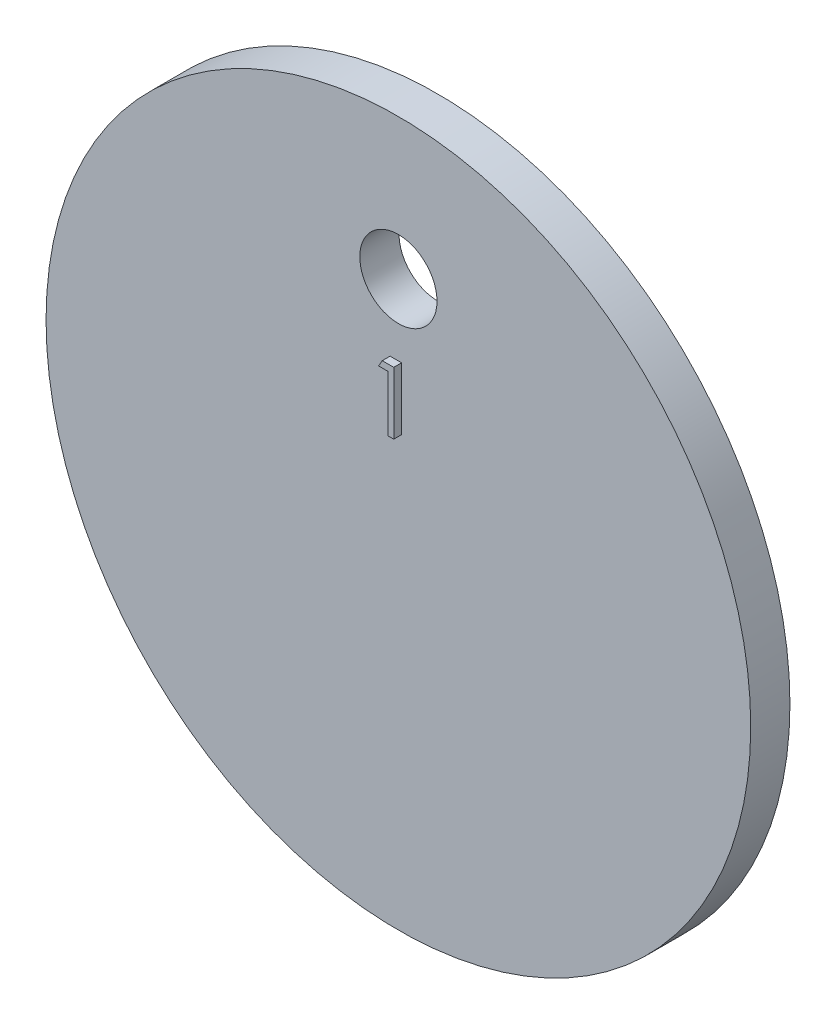
ISO-10303-21;
HEADER;
FILE_DESCRIPTION(('STEP AP214'),'2;1');
FILE_NAME('part.step','',(''),(''),'','','');
FILE_SCHEMA(('AUTOMOTIVE_DESIGN { 1 0 10303 214 1 1 1 1 }'));
ENDSEC;
DATA;
#1=APPLICATION_CONTEXT('core data for automotive mechanical design processes');
#2=APPLICATION_PROTOCOL_DEFINITION('international standard','automotive_design',2000,#1);
#3=PRODUCT_CONTEXT('',#1,'mechanical');
#4=PRODUCT('Part','Part','',(#3));
#5=PRODUCT_RELATED_PRODUCT_CATEGORY('part','',(#4));
#6=PRODUCT_DEFINITION_FORMATION('','',#4);
#7=PRODUCT_DEFINITION_CONTEXT('part definition',#1,'design');
#8=PRODUCT_DEFINITION('design','',#6,#7);
#9=PRODUCT_DEFINITION_SHAPE('','',#8);
#10=(LENGTH_UNIT() NAMED_UNIT(*) SI_UNIT(.MILLI.,.METRE.));
#11=(NAMED_UNIT(*) PLANE_ANGLE_UNIT() SI_UNIT($,.RADIAN.));
#12=(NAMED_UNIT(*) SI_UNIT($,.STERADIAN.) SOLID_ANGLE_UNIT());
#13=UNCERTAINTY_MEASURE_WITH_UNIT(LENGTH_MEASURE(1.E-05),#10,'distance_accuracy_value','');
#14=(GEOMETRIC_REPRESENTATION_CONTEXT(3) GLOBAL_UNCERTAINTY_ASSIGNED_CONTEXT((#13)) GLOBAL_UNIT_ASSIGNED_CONTEXT((#10,
#11,#12)) REPRESENTATION_CONTEXT('',''));
#15=CARTESIAN_POINT('',(0.,0.,0.));
#16=DIRECTION('',(0.,0.,1.));
#17=DIRECTION('',(1.,0.,0.));
#18=AXIS2_PLACEMENT_3D('',#15,#16,#17);
#19=CARTESIAN_POINT('',(0.,0.,5.));
#20=DIRECTION('',(0.,0.,1.));
#21=DIRECTION('',(1.,0.,0.));
#22=AXIS2_PLACEMENT_3D('',#19,#20,#21);
#23=PLANE('',#22);
#24=DIRECTION('',(0.496686511837683,0.867930013859709,0.));
#25=VECTOR('',#24,1.);
#26=CARTESIAN_POINT('',(-1.52644230769231,17.1233974358974,5.));
#27=LINE('',#26,#25);
#28=CARTESIAN_POINT('',(-1.52644230769231,17.1233974358974,5.));
#29=VERTEX_POINT('',#28);
#30=CARTESIAN_POINT('',(-1.06055939503205,17.9375,5.));
#31=VERTEX_POINT('',#30);
#32=EDGE_CURVE('E122',#29,#31,#27,.T.);
#33=ORIENTED_EDGE('',*,*,#32,.T.);
#34=DIRECTION('',(1.,0.,0.));
#35=VECTOR('',#34,1.);
#36=CARTESIAN_POINT('',(-1.06055939503205,17.9375,5.));
#37=LINE('',#36,#35);
#38=CARTESIAN_POINT('',(0.407051282051282,17.9375,5.));
#39=VERTEX_POINT('',#38);
#40=EDGE_CURVE('E91',#31,#39,#37,.T.);
#41=ORIENTED_EDGE('',*,*,#40,.T.);
#42=DIRECTION('',(0.,-1.,0.));
#43=VECTOR('',#42,1.);
#44=CARTESIAN_POINT('',(0.407051282051282,17.9375,5.));
#45=LINE('',#44,#43);
#46=CARTESIAN_POINT('',(0.407051282051282,10.,5.));
#47=VERTEX_POINT('',#46);
#48=EDGE_CURVE('E125',#39,#47,#45,.T.);
#49=ORIENTED_EDGE('',*,*,#48,.T.);
#50=DIRECTION('',(-1.,0.,0.));
#51=VECTOR('',#50,1.);
#52=CARTESIAN_POINT('',(0.407051282051282,10.,5.));
#53=LINE('',#52,#51);
#54=CARTESIAN_POINT('',(-0.305288461538461,10.,5.));
#55=VERTEX_POINT('',#54);
#56=EDGE_CURVE('E127',#47,#55,#53,.T.);
#57=ORIENTED_EDGE('',*,*,#56,.T.);
#58=DIRECTION('',(0.,1.,0.));
#59=VECTOR('',#58,1.);
#60=CARTESIAN_POINT('',(-0.305288461538461,10.,5.));
#61=LINE('',#60,#59);
#62=CARTESIAN_POINT('',(-0.305288461538461,17.1233974358974,5.));
#63=VERTEX_POINT('',#62);
#64=EDGE_CURVE('E53',#55,#63,#61,.T.);
#65=ORIENTED_EDGE('',*,*,#64,.T.);
#66=DIRECTION('',(-1.,0.,0.));
#67=VECTOR('',#66,1.);
#68=CARTESIAN_POINT('',(-0.305288461538461,17.1233974358974,5.));
#69=LINE('',#68,#67);
#70=EDGE_CURVE('E48',#63,#29,#69,.T.);
#71=ORIENTED_EDGE('',*,*,#70,.T.);
#72=EDGE_LOOP('',(#33,#41,#49,#57,#65,#71));
#73=FACE_BOUND('',#72,.T.);
#74=CARTESIAN_POINT('',(0.,0.,5.));
#75=DIRECTION('',(0.,0.,1.));
#76=DIRECTION('',(1.,0.,0.));
#77=AXIS2_PLACEMENT_3D('',#74,#75,#76);
#78=CIRCLE('',#77,44.9440717045652);
#79=CARTESIAN_POINT('',(44.9440717045652,0.,5.));
#80=VERTEX_POINT('',#79);
#81=EDGE_CURVE('E11',#80,#80,#78,.T.);
#82=ORIENTED_EDGE('',*,*,#81,.T.);
#83=EDGE_LOOP('',(#82));
#84=FACE_BOUND('',#83,.T.);
#85=CARTESIAN_POINT('',(0.,26.9875,5.));
#86=DIRECTION('',(0.,0.,1.));
#87=DIRECTION('',(1.,0.,0.));
#88=AXIS2_PLACEMENT_3D('',#85,#86,#87);
#89=CIRCLE('',#88,4.92369271165417);
#90=CARTESIAN_POINT('',(4.92369271165417,26.9875,5.));
#91=VERTEX_POINT('',#90);
#92=EDGE_CURVE('E141',#91,#91,#89,.T.);
#93=ORIENTED_EDGE('',*,*,#92,.F.);
#94=EDGE_LOOP('',(#93));
#95=FACE_BOUND('',#94,.T.);
#96=ADVANCED_FACE('F33',(#73,#84,#95),#23,.T.);
#97=CARTESIAN_POINT('',(0.,0.,0.));
#98=DIRECTION('',(0.,0.,1.));
#99=DIRECTION('',(1.,0.,0.));
#100=AXIS2_PLACEMENT_3D('',#97,#98,#99);
#101=PLANE('',#100);
#102=CARTESIAN_POINT('',(0.,0.,0.));
#103=DIRECTION('',(0.,0.,1.));
#104=DIRECTION('',(1.,0.,0.));
#105=AXIS2_PLACEMENT_3D('',#102,#103,#104);
#106=CIRCLE('',#105,44.9440717045652);
#107=CARTESIAN_POINT('',(44.9440717045652,0.,0.));
#108=VERTEX_POINT('',#107);
#109=EDGE_CURVE('E37',#108,#108,#106,.T.);
#110=ORIENTED_EDGE('',*,*,#109,.F.);
#111=EDGE_LOOP('',(#110));
#112=FACE_BOUND('',#111,.T.);
#113=CARTESIAN_POINT('',(0.,26.9875,0.));
#114=DIRECTION('',(0.,0.,1.));
#115=DIRECTION('',(1.,0.,0.));
#116=AXIS2_PLACEMENT_3D('',#113,#114,#115);
#117=CIRCLE('',#116,4.92369271165417);
#118=CARTESIAN_POINT('',(4.92369271165417,26.9875,0.));
#119=VERTEX_POINT('',#118);
#120=EDGE_CURVE('E131',#119,#119,#117,.T.);
#121=ORIENTED_EDGE('',*,*,#120,.T.);
#122=EDGE_LOOP('',(#121));
#123=FACE_BOUND('',#122,.T.);
#124=ADVANCED_FACE('F147',(#112,#123),#101,.F.);
#125=CARTESIAN_POINT('',(0.,0.,5.));
#126=DIRECTION('',(0.,0.,-1.));
#127=DIRECTION('',(-1.,0.,0.));
#128=AXIS2_PLACEMENT_3D('',#125,#126,#127);
#129=CYLINDRICAL_SURFACE('',#128,44.9440717045652);
#130=ORIENTED_EDGE('',*,*,#81,.F.);
#131=EDGE_LOOP('',(#130));
#132=FACE_BOUND('',#131,.T.);
#133=ORIENTED_EDGE('',*,*,#109,.T.);
#134=EDGE_LOOP('',(#133));
#135=FACE_BOUND('',#134,.T.);
#136=ADVANCED_FACE('F35',(#132,#135),#129,.T.);
#137=CARTESIAN_POINT('',(0.,26.9875,5.));
#138=DIRECTION('',(0.,0.,-1.));
#139=DIRECTION('',(-1.,0.,0.));
#140=AXIS2_PLACEMENT_3D('',#137,#138,#139);
#141=CYLINDRICAL_SURFACE('',#140,4.92369271165417);
#142=ORIENTED_EDGE('',*,*,#92,.T.);
#143=EDGE_LOOP('',(#142));
#144=FACE_BOUND('',#143,.T.);
#145=ORIENTED_EDGE('',*,*,#120,.F.);
#146=EDGE_LOOP('',(#145));
#147=FACE_BOUND('',#146,.T.);
#148=ADVANCED_FACE('F149',(#144,#147),#141,.F.);
#149=CARTESIAN_POINT('',(-1.52644230769231,17.1233974358974,6.));
#150=DIRECTION('',(-0.867930013859709,0.496686511837683,0.));
#151=DIRECTION('',(-0.496686511837683,-0.867930013859709,0.));
#152=AXIS2_PLACEMENT_3D('',#149,#150,#151);
#153=PLANE('',#152);
#154=ORIENTED_EDGE('',*,*,#32,.F.);
#155=DIRECTION('',(0.,0.,-1.));
#156=VECTOR('',#155,1.);
#157=CARTESIAN_POINT('',(-1.52644230769231,17.1233974358974,6.));
#158=LINE('',#157,#156);
#159=CARTESIAN_POINT('',(-1.52644230769231,17.1233974358974,6.));
#160=VERTEX_POINT('',#159);
#161=EDGE_CURVE('E110',#160,#29,#158,.T.);
#162=ORIENTED_EDGE('',*,*,#161,.F.);
#163=DIRECTION('',(0.496686511837683,0.867930013859709,0.));
#164=VECTOR('',#163,1.);
#165=CARTESIAN_POINT('',(-1.52644230769231,17.1233974358974,6.));
#166=LINE('',#165,#164);
#167=CARTESIAN_POINT('',(-1.06055939503205,17.9375,6.));
#168=VERTEX_POINT('',#167);
#169=EDGE_CURVE('E103',#160,#168,#166,.T.);
#170=ORIENTED_EDGE('',*,*,#169,.T.);
#171=DIRECTION('',(0.,0.,-1.));
#172=VECTOR('',#171,1.);
#173=CARTESIAN_POINT('',(-1.06055939503205,17.9375,6.));
#174=LINE('',#173,#172);
#175=EDGE_CURVE('E86',#168,#31,#174,.T.);
#176=ORIENTED_EDGE('',*,*,#175,.T.);
#177=EDGE_LOOP('',(#154,#162,#170,#176));
#178=FACE_BOUND('',#177,.T.);
#179=ADVANCED_FACE('F109',(#178),#153,.T.);
#180=CARTESIAN_POINT('',(-0.305288461538461,17.1233974358974,6.));
#181=DIRECTION('',(0.,-1.,0.));
#182=DIRECTION('',(0.,0.,-1.));
#183=AXIS2_PLACEMENT_3D('',#180,#181,#182);
#184=PLANE('',#183);
#185=ORIENTED_EDGE('',*,*,#70,.F.);
#186=DIRECTION('',(0.,0.,-1.));
#187=VECTOR('',#186,1.);
#188=CARTESIAN_POINT('',(-0.305288461538461,17.1233974358974,6.));
#189=LINE('',#188,#187);
#190=CARTESIAN_POINT('',(-0.305288461538461,17.1233974358974,6.));
#191=VERTEX_POINT('',#190);
#192=EDGE_CURVE('E132',#191,#63,#189,.T.);
#193=ORIENTED_EDGE('',*,*,#192,.F.);
#194=DIRECTION('',(-1.,0.,0.));
#195=VECTOR('',#194,1.);
#196=CARTESIAN_POINT('',(-0.305288461538461,17.1233974358974,6.));
#197=LINE('',#196,#195);
#198=EDGE_CURVE('E96',#191,#160,#197,.T.);
#199=ORIENTED_EDGE('',*,*,#198,.T.);
#200=ORIENTED_EDGE('',*,*,#161,.T.);
#201=EDGE_LOOP('',(#185,#193,#199,#200));
#202=FACE_BOUND('',#201,.T.);
#203=ADVANCED_FACE('F157',(#202),#184,.T.);
#204=CARTESIAN_POINT('',(-0.305288461538461,10.,6.));
#205=DIRECTION('',(-1.,0.,0.));
#206=DIRECTION('',(0.,0.,1.));
#207=AXIS2_PLACEMENT_3D('',#204,#205,#206);
#208=PLANE('',#207);
#209=ORIENTED_EDGE('',*,*,#64,.F.);
#210=DIRECTION('',(0.,0.,-1.));
#211=VECTOR('',#210,1.);
#212=CARTESIAN_POINT('',(-0.305288461538461,10.,6.));
#213=LINE('',#212,#211);
#214=CARTESIAN_POINT('',(-0.305288461538461,10.,6.));
#215=VERTEX_POINT('',#214);
#216=EDGE_CURVE('E134',#215,#55,#213,.T.);
#217=ORIENTED_EDGE('',*,*,#216,.F.);
#218=DIRECTION('',(0.,1.,0.));
#219=VECTOR('',#218,1.);
#220=CARTESIAN_POINT('',(-0.305288461538461,10.,6.));
#221=LINE('',#220,#219);
#222=EDGE_CURVE('E118',#215,#191,#221,.T.);
#223=ORIENTED_EDGE('',*,*,#222,.T.);
#224=ORIENTED_EDGE('',*,*,#192,.T.);
#225=EDGE_LOOP('',(#209,#217,#223,#224));
#226=FACE_BOUND('',#225,.T.);
#227=ADVANCED_FACE('F181',(#226),#208,.T.);
#228=CARTESIAN_POINT('',(0.407051282051282,10.,6.));
#229=DIRECTION('',(0.,-1.,0.));
#230=DIRECTION('',(0.,0.,-1.));
#231=AXIS2_PLACEMENT_3D('',#228,#229,#230);
#232=PLANE('',#231);
#233=ORIENTED_EDGE('',*,*,#56,.F.);
#234=DIRECTION('',(0.,0.,-1.));
#235=VECTOR('',#234,1.);
#236=CARTESIAN_POINT('',(0.407051282051282,10.,6.));
#237=LINE('',#236,#235);
#238=CARTESIAN_POINT('',(0.407051282051282,10.,6.));
#239=VERTEX_POINT('',#238);
#240=EDGE_CURVE('E137',#239,#47,#237,.T.);
#241=ORIENTED_EDGE('',*,*,#240,.F.);
#242=DIRECTION('',(-1.,0.,0.));
#243=VECTOR('',#242,1.);
#244=CARTESIAN_POINT('',(0.407051282051282,10.,6.));
#245=LINE('',#244,#243);
#246=EDGE_CURVE('E115',#239,#215,#245,.T.);
#247=ORIENTED_EDGE('',*,*,#246,.T.);
#248=ORIENTED_EDGE('',*,*,#216,.T.);
#249=EDGE_LOOP('',(#233,#241,#247,#248));
#250=FACE_BOUND('',#249,.T.);
#251=ADVANCED_FACE('F178',(#250),#232,.T.);
#252=CARTESIAN_POINT('',(0.407051282051282,17.9375,6.));
#253=DIRECTION('',(1.,0.,0.));
#254=DIRECTION('',(0.,0.,-1.));
#255=AXIS2_PLACEMENT_3D('',#252,#253,#254);
#256=PLANE('',#255);
#257=ORIENTED_EDGE('',*,*,#48,.F.);
#258=DIRECTION('',(0.,0.,-1.));
#259=VECTOR('',#258,1.);
#260=CARTESIAN_POINT('',(0.407051282051282,17.9375,6.));
#261=LINE('',#260,#259);
#262=CARTESIAN_POINT('',(0.407051282051282,17.9375,6.));
#263=VERTEX_POINT('',#262);
#264=EDGE_CURVE('E95',#263,#39,#261,.T.);
#265=ORIENTED_EDGE('',*,*,#264,.F.);
#266=DIRECTION('',(0.,-1.,0.));
#267=VECTOR('',#266,1.);
#268=CARTESIAN_POINT('',(0.407051282051282,17.9375,6.));
#269=LINE('',#268,#267);
#270=EDGE_CURVE('E107',#263,#239,#269,.T.);
#271=ORIENTED_EDGE('',*,*,#270,.T.);
#272=ORIENTED_EDGE('',*,*,#240,.T.);
#273=EDGE_LOOP('',(#257,#265,#271,#272));
#274=FACE_BOUND('',#273,.T.);
#275=ADVANCED_FACE('F175',(#274),#256,.T.);
#276=CARTESIAN_POINT('',(-1.06055939503205,17.9375,6.));
#277=DIRECTION('',(0.,1.,0.));
#278=DIRECTION('',(0.,0.,1.));
#279=AXIS2_PLACEMENT_3D('',#276,#277,#278);
#280=PLANE('',#279);
#281=ORIENTED_EDGE('',*,*,#40,.F.);
#282=ORIENTED_EDGE('',*,*,#175,.F.);
#283=DIRECTION('',(1.,0.,0.));
#284=VECTOR('',#283,1.);
#285=CARTESIAN_POINT('',(-1.06055939503205,17.9375,6.));
#286=LINE('',#285,#284);
#287=EDGE_CURVE('E90',#168,#263,#286,.T.);
#288=ORIENTED_EDGE('',*,*,#287,.T.);
#289=ORIENTED_EDGE('',*,*,#264,.T.);
#290=EDGE_LOOP('',(#281,#282,#288,#289));
#291=FACE_BOUND('',#290,.T.);
#292=ADVANCED_FACE('F88',(#291),#280,.T.);
#293=CARTESIAN_POINT('',(0.,0.,6.));
#294=DIRECTION('',(0.,0.,-1.));
#295=DIRECTION('',(-1.,0.,0.));
#296=AXIS2_PLACEMENT_3D('',#293,#294,#295);
#297=PLANE('',#296);
#298=ORIENTED_EDGE('',*,*,#169,.F.);
#299=ORIENTED_EDGE('',*,*,#198,.F.);
#300=ORIENTED_EDGE('',*,*,#222,.F.);
#301=ORIENTED_EDGE('',*,*,#246,.F.);
#302=ORIENTED_EDGE('',*,*,#270,.F.);
#303=ORIENTED_EDGE('',*,*,#287,.F.);
#304=EDGE_LOOP('',(#298,#299,#300,#301,#302,#303));
#305=FACE_BOUND('',#304,.T.);
#306=ADVANCED_FACE('F101',(#305),#297,.F.);
#307=CLOSED_SHELL('',(#96,#124,#136,#148,#179,#203,#227,#251,#275,#292,#306));
#308=MANIFOLD_SOLID_BREP('B2',#307);
#309=ADVANCED_BREP_SHAPE_REPRESENTATION('',(#18,#308),#14);
#310=SHAPE_DEFINITION_REPRESENTATION(#9,#309);
ENDSEC;
END-ISO-10303-21;
